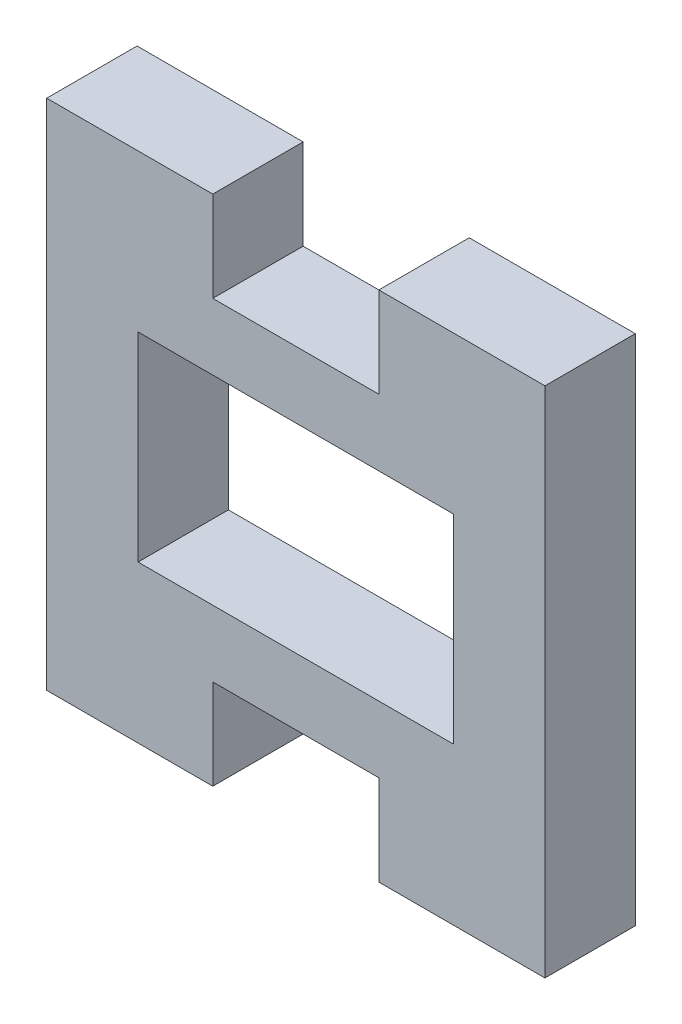
ISO-10303-21;
HEADER;
FILE_DESCRIPTION(('STEP AP214'),'2;1');
FILE_NAME('part.step','',(''),(''),'','','');
FILE_SCHEMA(('AUTOMOTIVE_DESIGN { 1 0 10303 214 1 1 1 1 }'));
ENDSEC;
DATA;
#1=APPLICATION_CONTEXT('core data for automotive mechanical design processes');
#2=APPLICATION_PROTOCOL_DEFINITION('international standard','automotive_design',2000,#1);
#3=PRODUCT_CONTEXT('',#1,'mechanical');
#4=PRODUCT('Part','Part','',(#3));
#5=PRODUCT_RELATED_PRODUCT_CATEGORY('part','',(#4));
#6=PRODUCT_DEFINITION_FORMATION('','',#4);
#7=PRODUCT_DEFINITION_CONTEXT('part definition',#1,'design');
#8=PRODUCT_DEFINITION('design','',#6,#7);
#9=PRODUCT_DEFINITION_SHAPE('','',#8);
#10=(LENGTH_UNIT() NAMED_UNIT(*) SI_UNIT(.MILLI.,.METRE.));
#11=(NAMED_UNIT(*) PLANE_ANGLE_UNIT() SI_UNIT($,.RADIAN.));
#12=(NAMED_UNIT(*) SI_UNIT($,.STERADIAN.) SOLID_ANGLE_UNIT());
#13=UNCERTAINTY_MEASURE_WITH_UNIT(LENGTH_MEASURE(1.E-05),#10,'distance_accuracy_value','');
#14=(GEOMETRIC_REPRESENTATION_CONTEXT(3) GLOBAL_UNCERTAINTY_ASSIGNED_CONTEXT((#13)) GLOBAL_UNIT_ASSIGNED_CONTEXT((#10,
#11,#12)) REPRESENTATION_CONTEXT('',''));
#15=CARTESIAN_POINT('',(0.,0.,0.));
#16=DIRECTION('',(0.,0.,1.));
#17=DIRECTION('',(1.,0.,0.));
#18=AXIS2_PLACEMENT_3D('',#15,#16,#17);
#19=CARTESIAN_POINT('',(0.,30.88,0.));
#20=DIRECTION('',(0.,0.,-1.));
#21=DIRECTION('',(-1.,0.,0.));
#22=AXIS2_PLACEMENT_3D('',#19,#20,#21);
#23=PLANE('',#22);
#24=DIRECTION('',(0.,-1.,0.));
#25=VECTOR('',#24,1.);
#26=CARTESIAN_POINT('',(24.5,21.44,0.));
#27=LINE('',#26,#25);
#28=CARTESIAN_POINT('',(24.5,21.44,0.));
#29=VERTEX_POINT('',#28);
#30=CARTESIAN_POINT('',(24.5,9.44,0.));
#31=VERTEX_POINT('',#30);
#32=EDGE_CURVE('E238',#29,#31,#27,.T.);
#33=ORIENTED_EDGE('',*,*,#32,.F.);
#34=DIRECTION('',(1.,0.,0.));
#35=VECTOR('',#34,1.);
#36=CARTESIAN_POINT('',(24.5,21.44,0.));
#37=LINE('',#36,#35);
#38=CARTESIAN_POINT('',(5.5,21.44,0.));
#39=VERTEX_POINT('',#38);
#40=EDGE_CURVE('E243',#39,#29,#37,.T.);
#41=ORIENTED_EDGE('',*,*,#40,.F.);
#42=DIRECTION('',(0.,1.,0.));
#43=VECTOR('',#42,1.);
#44=CARTESIAN_POINT('',(5.5,21.44,0.));
#45=LINE('',#44,#43);
#46=CARTESIAN_POINT('',(5.5,9.44,0.));
#47=VERTEX_POINT('',#46);
#48=EDGE_CURVE('E257',#47,#39,#45,.T.);
#49=ORIENTED_EDGE('',*,*,#48,.F.);
#50=DIRECTION('',(-1.,0.,0.));
#51=VECTOR('',#50,1.);
#52=CARTESIAN_POINT('',(24.5,9.44,0.));
#53=LINE('',#52,#51);
#54=EDGE_CURVE('E254',#31,#47,#53,.T.);
#55=ORIENTED_EDGE('',*,*,#54,.F.);
#56=EDGE_LOOP('',(#33,#41,#49,#55));
#57=FACE_BOUND('',#56,.T.);
#58=DIRECTION('',(1.,0.,0.));
#59=VECTOR('',#58,1.);
#60=CARTESIAN_POINT('',(10.,5.44,0.));
#61=LINE('',#60,#59);
#62=CARTESIAN_POINT('',(10.,5.44,0.));
#63=VERTEX_POINT('',#62);
#64=CARTESIAN_POINT('',(20.,5.44,0.));
#65=VERTEX_POINT('',#64);
#66=EDGE_CURVE('E211',#63,#65,#61,.T.);
#67=ORIENTED_EDGE('',*,*,#66,.F.);
#68=DIRECTION('',(0.,1.,0.));
#69=VECTOR('',#68,1.);
#70=CARTESIAN_POINT('',(10.,0.,0.));
#71=LINE('',#70,#69);
#72=CARTESIAN_POINT('',(10.,0.,0.));
#73=VERTEX_POINT('',#72);
#74=EDGE_CURVE('E156',#73,#63,#71,.T.);
#75=ORIENTED_EDGE('',*,*,#74,.F.);
#76=DIRECTION('',(1.,0.,0.));
#77=VECTOR('',#76,1.);
#78=CARTESIAN_POINT('',(0.,0.,0.));
#79=LINE('',#78,#77);
#80=CARTESIAN_POINT('',(0.,0.,0.));
#81=VERTEX_POINT('',#80);
#82=EDGE_CURVE('E165',#81,#73,#79,.T.);
#83=ORIENTED_EDGE('',*,*,#82,.F.);
#84=DIRECTION('',(0.,-1.,0.));
#85=VECTOR('',#84,1.);
#86=CARTESIAN_POINT('',(0.,0.,0.));
#87=LINE('',#86,#85);
#88=CARTESIAN_POINT('',(0.,30.88,0.));
#89=VERTEX_POINT('',#88);
#90=EDGE_CURVE('E184',#89,#81,#87,.T.);
#91=ORIENTED_EDGE('',*,*,#90,.F.);
#92=DIRECTION('',(-1.,0.,0.));
#93=VECTOR('',#92,1.);
#94=CARTESIAN_POINT('',(0.,30.88,0.));
#95=LINE('',#94,#93);
#96=CARTESIAN_POINT('',(9.99999999999999,30.88,0.));
#97=VERTEX_POINT('',#96);
#98=EDGE_CURVE('E192',#97,#89,#95,.T.);
#99=ORIENTED_EDGE('',*,*,#98,.F.);
#100=DIRECTION('',(0.,-1.,0.));
#101=VECTOR('',#100,1.);
#102=CARTESIAN_POINT('',(9.99999999999999,30.88,0.));
#103=LINE('',#102,#101);
#104=CARTESIAN_POINT('',(9.99999999999999,25.44,0.));
#105=VERTEX_POINT('',#104);
#106=EDGE_CURVE('E229',#97,#105,#103,.T.);
#107=ORIENTED_EDGE('',*,*,#106,.T.);
#108=DIRECTION('',(-1.,0.,0.));
#109=VECTOR('',#108,1.);
#110=CARTESIAN_POINT('',(9.99999999999999,25.44,0.));
#111=LINE('',#110,#109);
#112=CARTESIAN_POINT('',(20.,25.44,0.));
#113=VERTEX_POINT('',#112);
#114=EDGE_CURVE('E224',#113,#105,#111,.T.);
#115=ORIENTED_EDGE('',*,*,#114,.F.);
#116=DIRECTION('',(0.,-1.,0.));
#117=VECTOR('',#116,1.);
#118=CARTESIAN_POINT('',(20.,30.88,0.));
#119=LINE('',#118,#117);
#120=CARTESIAN_POINT('',(20.,30.88,0.));
#121=VERTEX_POINT('',#120);
#122=EDGE_CURVE('E54',#121,#113,#119,.T.);
#123=ORIENTED_EDGE('',*,*,#122,.F.);
#124=CARTESIAN_POINT('',(30.,30.88,0.));
#125=VERTEX_POINT('',#124);
#126=EDGE_CURVE('E193',#125,#121,#95,.T.);
#127=ORIENTED_EDGE('',*,*,#126,.F.);
#128=DIRECTION('',(0.,1.,0.));
#129=VECTOR('',#128,1.);
#130=CARTESIAN_POINT('',(30.,0.,0.));
#131=LINE('',#130,#129);
#132=CARTESIAN_POINT('',(30.,0.,0.));
#133=VERTEX_POINT('',#132);
#134=EDGE_CURVE('E190',#133,#125,#131,.T.);
#135=ORIENTED_EDGE('',*,*,#134,.F.);
#136=CARTESIAN_POINT('',(20.,0.,0.));
#137=VERTEX_POINT('',#136);
#138=EDGE_CURVE('E187',#137,#133,#79,.T.);
#139=ORIENTED_EDGE('',*,*,#138,.F.);
#140=DIRECTION('',(0.,1.,0.));
#141=VECTOR('',#140,1.);
#142=CARTESIAN_POINT('',(20.,0.,0.));
#143=LINE('',#142,#141);
#144=EDGE_CURVE('E212',#137,#65,#143,.T.);
#145=ORIENTED_EDGE('',*,*,#144,.T.);
#146=EDGE_LOOP('',(#67,#75,#83,#91,#99,#107,#115,#123,#127,#135,#139,#145));
#147=FACE_BOUND('',#146,.T.);
#148=ADVANCED_FACE('F31',(#57,#147),#23,.T.);
#149=CARTESIAN_POINT('',(0.,0.,5.44));
#150=DIRECTION('',(0.,1.,0.));
#151=DIRECTION('',(0.,0.,1.));
#152=AXIS2_PLACEMENT_3D('',#149,#150,#151);
#153=PLANE('',#152);
#154=DIRECTION('',(0.,0.,-1.));
#155=VECTOR('',#154,1.);
#156=CARTESIAN_POINT('',(10.,0.,5.44));
#157=LINE('',#156,#155);
#158=CARTESIAN_POINT('',(10.,0.,5.44));
#159=VERTEX_POINT('',#158);
#160=EDGE_CURVE('E150',#159,#73,#157,.T.);
#161=ORIENTED_EDGE('',*,*,#160,.F.);
#162=DIRECTION('',(1.,0.,0.));
#163=VECTOR('',#162,1.);
#164=CARTESIAN_POINT('',(0.,0.,5.44));
#165=LINE('',#164,#163);
#166=CARTESIAN_POINT('',(0.,0.,5.44));
#167=VERTEX_POINT('',#166);
#168=EDGE_CURVE('E163',#167,#159,#165,.T.);
#169=ORIENTED_EDGE('',*,*,#168,.F.);
#170=DIRECTION('',(0.,0.,-1.));
#171=VECTOR('',#170,1.);
#172=CARTESIAN_POINT('',(0.,0.,5.44));
#173=LINE('',#172,#171);
#174=EDGE_CURVE('E39',#167,#81,#173,.T.);
#175=ORIENTED_EDGE('',*,*,#174,.T.);
#176=ORIENTED_EDGE('',*,*,#82,.T.);
#177=EDGE_LOOP('',(#161,#169,#175,#176));
#178=FACE_BOUND('',#177,.T.);
#179=ADVANCED_FACE('F161',(#178),#153,.F.);
#180=DIRECTION('',(0.,0.,1.));
#181=VECTOR('',#180,1.);
#182=CARTESIAN_POINT('',(20.,0.,5.44));
#183=LINE('',#182,#181);
#184=CARTESIAN_POINT('',(20.,0.,5.44));
#185=VERTEX_POINT('',#184);
#186=EDGE_CURVE('E166',#137,#185,#183,.T.);
#187=ORIENTED_EDGE('',*,*,#186,.F.);
#188=ORIENTED_EDGE('',*,*,#138,.T.);
#189=DIRECTION('',(0.,0.,-1.));
#190=VECTOR('',#189,1.);
#191=CARTESIAN_POINT('',(30.,0.,5.44));
#192=LINE('',#191,#190);
#193=CARTESIAN_POINT('',(30.,0.,5.44));
#194=VERTEX_POINT('',#193);
#195=EDGE_CURVE('E201',#194,#133,#192,.T.);
#196=ORIENTED_EDGE('',*,*,#195,.F.);
#197=EDGE_CURVE('E173',#185,#194,#165,.T.);
#198=ORIENTED_EDGE('',*,*,#197,.F.);
#199=EDGE_LOOP('',(#187,#188,#196,#198));
#200=FACE_BOUND('',#199,.T.);
#201=ADVANCED_FACE('F299',(#200),#153,.F.);
#202=CARTESIAN_POINT('',(0.,30.88,5.44));
#203=DIRECTION('',(0.,-1.,0.));
#204=DIRECTION('',(0.,0.,-1.));
#205=AXIS2_PLACEMENT_3D('',#202,#203,#204);
#206=PLANE('',#205);
#207=DIRECTION('',(0.,0.,-1.));
#208=VECTOR('',#207,1.);
#209=CARTESIAN_POINT('',(20.,30.88,0.));
#210=LINE('',#209,#208);
#211=CARTESIAN_POINT('',(20.,30.88,5.44));
#212=VERTEX_POINT('',#211);
#213=EDGE_CURVE('E217',#212,#121,#210,.T.);
#214=ORIENTED_EDGE('',*,*,#213,.F.);
#215=DIRECTION('',(-1.,0.,0.));
#216=VECTOR('',#215,1.);
#217=CARTESIAN_POINT('',(0.,30.88,5.44));
#218=LINE('',#217,#216);
#219=CARTESIAN_POINT('',(30.,30.88,5.44));
#220=VERTEX_POINT('',#219);
#221=EDGE_CURVE('E180',#220,#212,#218,.T.);
#222=ORIENTED_EDGE('',*,*,#221,.F.);
#223=DIRECTION('',(0.,0.,-1.));
#224=VECTOR('',#223,1.);
#225=CARTESIAN_POINT('',(30.,30.88,5.44));
#226=LINE('',#225,#224);
#227=EDGE_CURVE('E198',#220,#125,#226,.T.);
#228=ORIENTED_EDGE('',*,*,#227,.T.);
#229=ORIENTED_EDGE('',*,*,#126,.T.);
#230=EDGE_LOOP('',(#214,#222,#228,#229));
#231=FACE_BOUND('',#230,.T.);
#232=ADVANCED_FACE('F302',(#231),#206,.F.);
#233=DIRECTION('',(0.,0.,1.));
#234=VECTOR('',#233,1.);
#235=CARTESIAN_POINT('',(9.99999999999999,30.88,0.));
#236=LINE('',#235,#234);
#237=CARTESIAN_POINT('',(9.99999999999999,30.88,5.44));
#238=VERTEX_POINT('',#237);
#239=EDGE_CURVE('E219',#97,#238,#236,.T.);
#240=ORIENTED_EDGE('',*,*,#239,.F.);
#241=ORIENTED_EDGE('',*,*,#98,.T.);
#242=DIRECTION('',(0.,0.,-1.));
#243=VECTOR('',#242,1.);
#244=CARTESIAN_POINT('',(0.,30.88,5.44));
#245=LINE('',#244,#243);
#246=CARTESIAN_POINT('',(0.,30.88,5.44));
#247=VERTEX_POINT('',#246);
#248=EDGE_CURVE('E183',#247,#89,#245,.T.);
#249=ORIENTED_EDGE('',*,*,#248,.F.);
#250=EDGE_CURVE('E175',#238,#247,#218,.T.);
#251=ORIENTED_EDGE('',*,*,#250,.F.);
#252=EDGE_LOOP('',(#240,#241,#249,#251));
#253=FACE_BOUND('',#252,.T.);
#254=ADVANCED_FACE('F305',(#253),#206,.F.);
#255=CARTESIAN_POINT('',(0.,0.,5.44));
#256=DIRECTION('',(1.,0.,0.));
#257=DIRECTION('',(0.,1.,0.));
#258=AXIS2_PLACEMENT_3D('',#255,#256,#257);
#259=PLANE('',#258);
#260=ORIENTED_EDGE('',*,*,#90,.T.);
#261=ORIENTED_EDGE('',*,*,#174,.F.);
#262=DIRECTION('',(0.,-1.,0.));
#263=VECTOR('',#262,1.);
#264=CARTESIAN_POINT('',(0.,0.,5.44));
#265=LINE('',#264,#263);
#266=EDGE_CURVE('E171',#247,#167,#265,.T.);
#267=ORIENTED_EDGE('',*,*,#266,.F.);
#268=ORIENTED_EDGE('',*,*,#248,.T.);
#269=EDGE_LOOP('',(#260,#261,#267,#268));
#270=FACE_BOUND('',#269,.T.);
#271=ADVANCED_FACE('F33',(#270),#259,.F.);
#272=CARTESIAN_POINT('',(30.,0.,5.44));
#273=DIRECTION('',(-1.,0.,0.));
#274=DIRECTION('',(0.,-1.,0.));
#275=AXIS2_PLACEMENT_3D('',#272,#273,#274);
#276=PLANE('',#275);
#277=ORIENTED_EDGE('',*,*,#134,.T.);
#278=ORIENTED_EDGE('',*,*,#227,.F.);
#279=DIRECTION('',(0.,1.,0.));
#280=VECTOR('',#279,1.);
#281=CARTESIAN_POINT('',(30.,0.,5.44));
#282=LINE('',#281,#280);
#283=EDGE_CURVE('E172',#194,#220,#282,.T.);
#284=ORIENTED_EDGE('',*,*,#283,.F.);
#285=ORIENTED_EDGE('',*,*,#195,.T.);
#286=EDGE_LOOP('',(#277,#278,#284,#285));
#287=FACE_BOUND('',#286,.T.);
#288=ADVANCED_FACE('F307',(#287),#276,.F.);
#289=CARTESIAN_POINT('',(0.,30.88,5.44));
#290=DIRECTION('',(0.,0.,-1.));
#291=DIRECTION('',(-1.,0.,0.));
#292=AXIS2_PLACEMENT_3D('',#289,#290,#291);
#293=PLANE('',#292);
#294=DIRECTION('',(1.,0.,0.));
#295=VECTOR('',#294,1.);
#296=CARTESIAN_POINT('',(24.5,21.44,5.44));
#297=LINE('',#296,#295);
#298=CARTESIAN_POINT('',(5.5,21.44,5.44));
#299=VERTEX_POINT('',#298);
#300=CARTESIAN_POINT('',(24.5,21.44,5.44));
#301=VERTEX_POINT('',#300);
#302=EDGE_CURVE('E249',#299,#301,#297,.T.);
#303=ORIENTED_EDGE('',*,*,#302,.T.);
#304=DIRECTION('',(0.,-1.,0.));
#305=VECTOR('',#304,1.);
#306=CARTESIAN_POINT('',(24.5,21.44,5.44));
#307=LINE('',#306,#305);
#308=CARTESIAN_POINT('',(24.5,9.44,5.44));
#309=VERTEX_POINT('',#308);
#310=EDGE_CURVE('E239',#301,#309,#307,.T.);
#311=ORIENTED_EDGE('',*,*,#310,.T.);
#312=DIRECTION('',(-1.,0.,0.));
#313=VECTOR('',#312,1.);
#314=CARTESIAN_POINT('',(24.5,9.44,5.44));
#315=LINE('',#314,#313);
#316=CARTESIAN_POINT('',(5.5,9.44,5.44));
#317=VERTEX_POINT('',#316);
#318=EDGE_CURVE('E242',#309,#317,#315,.T.);
#319=ORIENTED_EDGE('',*,*,#318,.T.);
#320=DIRECTION('',(0.,1.,0.));
#321=VECTOR('',#320,1.);
#322=CARTESIAN_POINT('',(5.5,21.44,5.44));
#323=LINE('',#322,#321);
#324=EDGE_CURVE('E246',#317,#299,#323,.T.);
#325=ORIENTED_EDGE('',*,*,#324,.T.);
#326=EDGE_LOOP('',(#303,#311,#319,#325));
#327=FACE_BOUND('',#326,.T.);
#328=ORIENTED_EDGE('',*,*,#266,.T.);
#329=ORIENTED_EDGE('',*,*,#168,.T.);
#330=DIRECTION('',(0.,1.,0.));
#331=VECTOR('',#330,1.);
#332=CARTESIAN_POINT('',(10.,0.,5.44));
#333=LINE('',#332,#331);
#334=CARTESIAN_POINT('',(10.,5.44,5.44));
#335=VERTEX_POINT('',#334);
#336=EDGE_CURVE('E146',#159,#335,#333,.T.);
#337=ORIENTED_EDGE('',*,*,#336,.T.);
#338=DIRECTION('',(1.,0.,0.));
#339=VECTOR('',#338,1.);
#340=CARTESIAN_POINT('',(0.,5.44,5.44));
#341=LINE('',#340,#339);
#342=CARTESIAN_POINT('',(20.,5.44,5.44));
#343=VERTEX_POINT('',#342);
#344=EDGE_CURVE('E11',#335,#343,#341,.T.);
#345=ORIENTED_EDGE('',*,*,#344,.T.);
#346=DIRECTION('',(0.,1.,0.));
#347=VECTOR('',#346,1.);
#348=CARTESIAN_POINT('',(20.,0.,5.44));
#349=LINE('',#348,#347);
#350=EDGE_CURVE('E46',#185,#343,#349,.T.);
#351=ORIENTED_EDGE('',*,*,#350,.F.);
#352=ORIENTED_EDGE('',*,*,#197,.T.);
#353=ORIENTED_EDGE('',*,*,#283,.T.);
#354=ORIENTED_EDGE('',*,*,#221,.T.);
#355=DIRECTION('',(0.,-1.,0.));
#356=VECTOR('',#355,1.);
#357=CARTESIAN_POINT('',(20.,30.88,5.44));
#358=LINE('',#357,#356);
#359=CARTESIAN_POINT('',(20.,25.44,5.44));
#360=VERTEX_POINT('',#359);
#361=EDGE_CURVE('E232',#212,#360,#358,.T.);
#362=ORIENTED_EDGE('',*,*,#361,.T.);
#363=DIRECTION('',(-1.,0.,0.));
#364=VECTOR('',#363,1.);
#365=CARTESIAN_POINT('',(0.,25.44,5.44));
#366=LINE('',#365,#364);
#367=CARTESIAN_POINT('',(9.99999999999999,25.44,5.44));
#368=VERTEX_POINT('',#367);
#369=EDGE_CURVE('E235',#360,#368,#366,.T.);
#370=ORIENTED_EDGE('',*,*,#369,.T.);
#371=DIRECTION('',(0.,-1.,0.));
#372=VECTOR('',#371,1.);
#373=CARTESIAN_POINT('',(9.99999999999999,30.88,5.44));
#374=LINE('',#373,#372);
#375=EDGE_CURVE('E222',#238,#368,#374,.T.);
#376=ORIENTED_EDGE('',*,*,#375,.F.);
#377=ORIENTED_EDGE('',*,*,#250,.T.);
#378=EDGE_LOOP('',(#328,#329,#337,#345,#351,#352,#353,#354,#362,#370,#376,#377));
#379=FACE_BOUND('',#378,.T.);
#380=ADVANCED_FACE('F169',(#327,#379),#293,.F.);
#381=CARTESIAN_POINT('',(24.5,21.44,5.44));
#382=DIRECTION('',(1.,0.,0.));
#383=DIRECTION('',(0.,0.,-1.));
#384=AXIS2_PLACEMENT_3D('',#381,#382,#383);
#385=PLANE('',#384);
#386=ORIENTED_EDGE('',*,*,#32,.T.);
#387=DIRECTION('',(0.,0.,-1.));
#388=VECTOR('',#387,1.);
#389=CARTESIAN_POINT('',(24.5,9.44,5.44));
#390=LINE('',#389,#388);
#391=EDGE_CURVE('E252',#309,#31,#390,.T.);
#392=ORIENTED_EDGE('',*,*,#391,.F.);
#393=ORIENTED_EDGE('',*,*,#310,.F.);
#394=DIRECTION('',(0.,0.,-1.));
#395=VECTOR('',#394,1.);
#396=CARTESIAN_POINT('',(24.5,21.44,5.44));
#397=LINE('',#396,#395);
#398=EDGE_CURVE('E188',#301,#29,#397,.T.);
#399=ORIENTED_EDGE('',*,*,#398,.T.);
#400=EDGE_LOOP('',(#386,#392,#393,#399));
#401=FACE_BOUND('',#400,.T.);
#402=ADVANCED_FACE('F282',(#401),#385,.F.);
#403=CARTESIAN_POINT('',(24.5,21.44,5.44));
#404=DIRECTION('',(0.,1.,0.));
#405=DIRECTION('',(0.,0.,1.));
#406=AXIS2_PLACEMENT_3D('',#403,#404,#405);
#407=PLANE('',#406);
#408=ORIENTED_EDGE('',*,*,#40,.T.);
#409=ORIENTED_EDGE('',*,*,#398,.F.);
#410=ORIENTED_EDGE('',*,*,#302,.F.);
#411=DIRECTION('',(0.,0.,-1.));
#412=VECTOR('',#411,1.);
#413=CARTESIAN_POINT('',(5.5,21.44,5.44));
#414=LINE('',#413,#412);
#415=EDGE_CURVE('E263',#299,#39,#414,.T.);
#416=ORIENTED_EDGE('',*,*,#415,.T.);
#417=EDGE_LOOP('',(#408,#409,#410,#416));
#418=FACE_BOUND('',#417,.T.);
#419=ADVANCED_FACE('F284',(#418),#407,.F.);
#420=CARTESIAN_POINT('',(5.5,21.44,5.44));
#421=DIRECTION('',(-1.,0.,0.));
#422=DIRECTION('',(0.,0.,1.));
#423=AXIS2_PLACEMENT_3D('',#420,#421,#422);
#424=PLANE('',#423);
#425=ORIENTED_EDGE('',*,*,#48,.T.);
#426=ORIENTED_EDGE('',*,*,#415,.F.);
#427=ORIENTED_EDGE('',*,*,#324,.F.);
#428=DIRECTION('',(0.,0.,-1.));
#429=VECTOR('',#428,1.);
#430=CARTESIAN_POINT('',(5.5,9.44,5.44));
#431=LINE('',#430,#429);
#432=EDGE_CURVE('E265',#317,#47,#431,.T.);
#433=ORIENTED_EDGE('',*,*,#432,.T.);
#434=EDGE_LOOP('',(#425,#426,#427,#433));
#435=FACE_BOUND('',#434,.T.);
#436=ADVANCED_FACE('F279',(#435),#424,.F.);
#437=CARTESIAN_POINT('',(24.5,9.44,5.44));
#438=DIRECTION('',(0.,-1.,0.));
#439=DIRECTION('',(0.,0.,-1.));
#440=AXIS2_PLACEMENT_3D('',#437,#438,#439);
#441=PLANE('',#440);
#442=ORIENTED_EDGE('',*,*,#54,.T.);
#443=ORIENTED_EDGE('',*,*,#432,.F.);
#444=ORIENTED_EDGE('',*,*,#318,.F.);
#445=ORIENTED_EDGE('',*,*,#391,.T.);
#446=EDGE_LOOP('',(#442,#443,#444,#445));
#447=FACE_BOUND('',#446,.T.);
#448=ADVANCED_FACE('F270',(#447),#441,.F.);
#449=CARTESIAN_POINT('',(0.,25.44,5.44000000000001));
#450=DIRECTION('',(0.,-1.,0.));
#451=DIRECTION('',(-1.,0.,0.));
#452=AXIS2_PLACEMENT_3D('',#449,#450,#451);
#453=PLANE('',#452);
#454=DIRECTION('',(0.,0.,-1.));
#455=VECTOR('',#454,1.);
#456=CARTESIAN_POINT('',(20.,25.44,0.));
#457=LINE('',#456,#455);
#458=EDGE_CURVE('E155',#360,#113,#457,.T.);
#459=ORIENTED_EDGE('',*,*,#458,.T.);
#460=ORIENTED_EDGE('',*,*,#114,.T.);
#461=DIRECTION('',(0.,0.,1.));
#462=VECTOR('',#461,1.);
#463=CARTESIAN_POINT('',(9.99999999999999,25.44,0.));
#464=LINE('',#463,#462);
#465=EDGE_CURVE('E220',#105,#368,#464,.T.);
#466=ORIENTED_EDGE('',*,*,#465,.T.);
#467=ORIENTED_EDGE('',*,*,#369,.F.);
#468=EDGE_LOOP('',(#459,#460,#466,#467));
#469=FACE_BOUND('',#468,.T.);
#470=ADVANCED_FACE('F325',(#469),#453,.F.);
#471=CARTESIAN_POINT('',(20.,30.88,0.));
#472=DIRECTION('',(-1.,0.,0.));
#473=DIRECTION('',(0.,1.,0.));
#474=AXIS2_PLACEMENT_3D('',#471,#472,#473);
#475=PLANE('',#474);
#476=ORIENTED_EDGE('',*,*,#458,.F.);
#477=ORIENTED_EDGE('',*,*,#361,.F.);
#478=ORIENTED_EDGE('',*,*,#213,.T.);
#479=ORIENTED_EDGE('',*,*,#122,.T.);
#480=EDGE_LOOP('',(#476,#477,#478,#479));
#481=FACE_BOUND('',#480,.T.);
#482=ADVANCED_FACE('F331',(#481),#475,.T.);
#483=CARTESIAN_POINT('',(9.99999999999999,30.88,0.));
#484=DIRECTION('',(1.,0.,0.));
#485=DIRECTION('',(0.,0.,-1.));
#486=AXIS2_PLACEMENT_3D('',#483,#484,#485);
#487=PLANE('',#486);
#488=ORIENTED_EDGE('',*,*,#465,.F.);
#489=ORIENTED_EDGE('',*,*,#106,.F.);
#490=ORIENTED_EDGE('',*,*,#239,.T.);
#491=ORIENTED_EDGE('',*,*,#375,.T.);
#492=EDGE_LOOP('',(#488,#489,#490,#491));
#493=FACE_BOUND('',#492,.T.);
#494=ADVANCED_FACE('F327',(#493),#487,.T.);
#495=CARTESIAN_POINT('',(0.,5.44,30.44));
#496=DIRECTION('',(0.,1.,0.));
#497=DIRECTION('',(-1.,0.,0.));
#498=AXIS2_PLACEMENT_3D('',#495,#496,#497);
#499=PLANE('',#498);
#500=DIRECTION('',(0.,0.,-1.));
#501=VECTOR('',#500,1.);
#502=CARTESIAN_POINT('',(10.,5.44,5.44));
#503=LINE('',#502,#501);
#504=EDGE_CURVE('E152',#335,#63,#503,.T.);
#505=ORIENTED_EDGE('',*,*,#504,.T.);
#506=ORIENTED_EDGE('',*,*,#66,.T.);
#507=DIRECTION('',(0.,0.,1.));
#508=VECTOR('',#507,1.);
#509=CARTESIAN_POINT('',(20.,5.44,5.44));
#510=LINE('',#509,#508);
#511=EDGE_CURVE('E167',#65,#343,#510,.T.);
#512=ORIENTED_EDGE('',*,*,#511,.T.);
#513=ORIENTED_EDGE('',*,*,#344,.F.);
#514=EDGE_LOOP('',(#505,#506,#512,#513));
#515=FACE_BOUND('',#514,.T.);
#516=ADVANCED_FACE('F341',(#515),#499,.F.);
#517=CARTESIAN_POINT('',(10.,0.,5.44));
#518=DIRECTION('',(1.,0.,0.));
#519=DIRECTION('',(0.,1.,0.));
#520=AXIS2_PLACEMENT_3D('',#517,#518,#519);
#521=PLANE('',#520);
#522=ORIENTED_EDGE('',*,*,#504,.F.);
#523=ORIENTED_EDGE('',*,*,#336,.F.);
#524=ORIENTED_EDGE('',*,*,#160,.T.);
#525=ORIENTED_EDGE('',*,*,#74,.T.);
#526=EDGE_LOOP('',(#522,#523,#524,#525));
#527=FACE_BOUND('',#526,.T.);
#528=ADVANCED_FACE('F148',(#527),#521,.T.);
#529=CARTESIAN_POINT('',(20.,0.,5.44));
#530=DIRECTION('',(-1.,0.,0.));
#531=DIRECTION('',(0.,-1.,0.));
#532=AXIS2_PLACEMENT_3D('',#529,#530,#531);
#533=PLANE('',#532);
#534=ORIENTED_EDGE('',*,*,#511,.F.);
#535=ORIENTED_EDGE('',*,*,#144,.F.);
#536=ORIENTED_EDGE('',*,*,#186,.T.);
#537=ORIENTED_EDGE('',*,*,#350,.T.);
#538=EDGE_LOOP('',(#534,#535,#536,#537));
#539=FACE_BOUND('',#538,.T.);
#540=ADVANCED_FACE('F335',(#539),#533,.T.);
#541=CLOSED_SHELL('',(#148,#179,#201,#232,#254,#271,#288,#380,#402,#419,#436,#448,#470,#482,
#494,#516,#528,#540));
#542=MANIFOLD_SOLID_BREP('B2',#541);
#543=ADVANCED_BREP_SHAPE_REPRESENTATION('',(#18,#542),#14);
#544=SHAPE_DEFINITION_REPRESENTATION(#9,#543);
ENDSEC;
END-ISO-10303-21;
